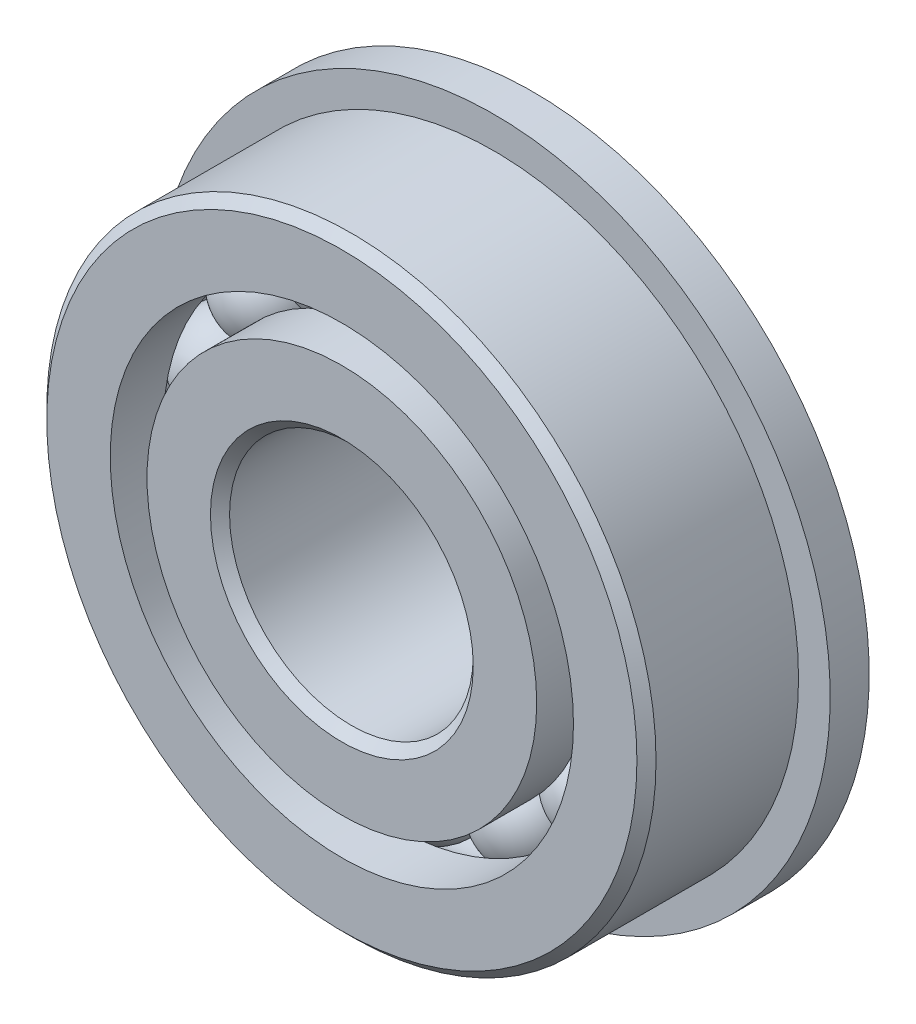
ISO-10303-21;
HEADER;
FILE_DESCRIPTION(('STEP AP214'),'2;1');
FILE_NAME('part.step','',(''),(''),'','','');
FILE_SCHEMA(('AUTOMOTIVE_DESIGN { 1 0 10303 214 1 1 1 1 }'));
ENDSEC;
DATA;
#1=APPLICATION_CONTEXT('core data for automotive mechanical design processes');
#2=APPLICATION_PROTOCOL_DEFINITION('international standard','automotive_design',2000,#1);
#3=PRODUCT_CONTEXT('',#1,'mechanical');
#4=PRODUCT('Part','Part','',(#3));
#5=PRODUCT_RELATED_PRODUCT_CATEGORY('part','',(#4));
#6=PRODUCT_DEFINITION_FORMATION('','',#4);
#7=PRODUCT_DEFINITION_CONTEXT('part definition',#1,'design');
#8=PRODUCT_DEFINITION('design','',#6,#7);
#9=PRODUCT_DEFINITION_SHAPE('','',#8);
#10=(LENGTH_UNIT() NAMED_UNIT(*) SI_UNIT(.MILLI.,.METRE.));
#11=(NAMED_UNIT(*) PLANE_ANGLE_UNIT() SI_UNIT($,.RADIAN.));
#12=(NAMED_UNIT(*) SI_UNIT($,.STERADIAN.) SOLID_ANGLE_UNIT());
#13=UNCERTAINTY_MEASURE_WITH_UNIT(LENGTH_MEASURE(1.E-05),#10,'distance_accuracy_value','');
#14=(GEOMETRIC_REPRESENTATION_CONTEXT(3) GLOBAL_UNCERTAINTY_ASSIGNED_CONTEXT((#13)) GLOBAL_UNIT_ASSIGNED_CONTEXT((#10,
#11,#12)) REPRESENTATION_CONTEXT('',''));
#15=CARTESIAN_POINT('',(0.,0.,0.));
#16=DIRECTION('',(0.,0.,1.));
#17=DIRECTION('',(1.,0.,0.));
#18=AXIS2_PLACEMENT_3D('',#15,#16,#17);
#19=CARTESIAN_POINT('',(-2.41076652547187,5.00600827228285,0.));
#20=DIRECTION('',(0.,0.,1.));
#21=DIRECTION('',(-0.433883739117546,0.900968867902425,0.));
#22=AXIS2_PLACEMENT_3D('',#19,#20,#21);
#23=SPHERICAL_SURFACE('',#22,1.20554465033679);
#24=CARTESIAN_POINT('',(-2.41076652547187,5.00600827228285,1.20554465033679));
#25=VERTEX_POINT('',#24);
#26=VERTEX_LOOP('',#25);
#27=FACE_BOUND('',#26,.T.);
#28=ADVANCED_FACE('F35',(#27),#23,.T.);
#29=CLOSED_SHELL('',(#28));
#30=MANIFOLD_SOLID_BREP('B2',#29);
#31=CARTESIAN_POINT('',(-4.34405117446295,3.46426521157764,0.));
#32=DIRECTION('',(0.,0.,1.));
#33=DIRECTION('',(-0.781831482468022,0.623489801858743,0.));
#34=AXIS2_PLACEMENT_3D('',#31,#32,#33);
#35=SPHERICAL_SURFACE('',#34,1.20554465033679);
#36=CARTESIAN_POINT('',(-4.34405117446295,3.46426521157764,1.20554465033679));
#37=VERTEX_POINT('',#36);
#38=VERTEX_LOOP('',#37);
#39=FACE_BOUND('',#38,.T.);
#40=ADVANCED_FACE('F55',(#39),#35,.T.);
#41=CLOSED_SHELL('',(#40));
#42=MANIFOLD_SOLID_BREP('B6',#41);
#43=CARTESIAN_POINT('',(-5.41694321206024,1.23638193929483,0.));
#44=DIRECTION('',(0.,0.,1.));
#45=DIRECTION('',(-0.974927912181821,0.222520933956325,0.));
#46=AXIS2_PLACEMENT_3D('',#43,#44,#45);
#47=SPHERICAL_SURFACE('',#46,1.20554465033679);
#48=CARTESIAN_POINT('',(-5.41694321206024,1.23638193929483,1.20554465033679));
#49=VERTEX_POINT('',#48);
#50=VERTEX_LOOP('',#49);
#51=FACE_BOUND('',#50,.T.);
#52=ADVANCED_FACE('F75',(#51),#47,.T.);
#53=CLOSED_SHELL('',(#52));
#54=MANIFOLD_SOLID_BREP('B31',#53);
#55=CARTESIAN_POINT('',(-5.41694321206027,-1.23638193929472,0.));
#56=DIRECTION('',(0.,0.,1.));
#57=DIRECTION('',(-0.974927912181826,-0.222520933956305,0.));
#58=AXIS2_PLACEMENT_3D('',#55,#56,#57);
#59=SPHERICAL_SURFACE('',#58,1.20554465033679);
#60=CARTESIAN_POINT('',(-5.41694321206027,-1.23638193929472,1.20554465033679));
#61=VERTEX_POINT('',#60);
#62=VERTEX_LOOP('',#61);
#63=FACE_BOUND('',#62,.T.);
#64=ADVANCED_FACE('F95',(#63),#59,.T.);
#65=CLOSED_SHELL('',(#64));
#66=MANIFOLD_SOLID_BREP('B51',#65);
#67=CARTESIAN_POINT('',(-4.34405117446302,-3.46426521157755,0.));
#68=DIRECTION('',(0.,0.,1.));
#69=DIRECTION('',(-0.781831482468035,-0.623489801858727,0.));
#70=AXIS2_PLACEMENT_3D('',#67,#68,#69);
#71=SPHERICAL_SURFACE('',#70,1.20554465033679);
#72=CARTESIAN_POINT('',(-4.34405117446302,-3.46426521157755,1.20554465033679));
#73=VERTEX_POINT('',#72);
#74=VERTEX_LOOP('',#73);
#75=FACE_BOUND('',#74,.T.);
#76=ADVANCED_FACE('F115',(#75),#71,.T.);
#77=CLOSED_SHELL('',(#76));
#78=MANIFOLD_SOLID_BREP('B71',#77);
#79=CARTESIAN_POINT('',(-2.41076652547197,-5.0060082722828,0.));
#80=DIRECTION('',(0.,0.,1.));
#81=DIRECTION('',(-0.433883739117565,-0.900968867902416,0.));
#82=AXIS2_PLACEMENT_3D('',#79,#80,#81);
#83=SPHERICAL_SURFACE('',#82,1.20554465033679);
#84=CARTESIAN_POINT('',(-2.41076652547197,-5.0060082722828,1.20554465033679));
#85=VERTEX_POINT('',#84);
#86=VERTEX_LOOP('',#85);
#87=FACE_BOUND('',#86,.T.);
#88=ADVANCED_FACE('F135',(#87),#83,.T.);
#89=CLOSED_SHELL('',(#88));
#90=MANIFOLD_SOLID_BREP('B91',#89);
#91=CARTESIAN_POINT('',(0.,-5.55625,0.));
#92=DIRECTION('',(0.,0.,1.));
#93=DIRECTION('',(0.,-1.,0.));
#94=AXIS2_PLACEMENT_3D('',#91,#92,#93);
#95=SPHERICAL_SURFACE('',#94,1.20554465033679);
#96=CARTESIAN_POINT('',(0.,-5.55625,1.20554465033679));
#97=VERTEX_POINT('',#96);
#98=VERTEX_LOOP('',#97);
#99=FACE_BOUND('',#98,.T.);
#100=ADVANCED_FACE('F155',(#99),#95,.T.);
#101=CLOSED_SHELL('',(#100));
#102=MANIFOLD_SOLID_BREP('B111',#101);
#103=CARTESIAN_POINT('',(2.4107665254719,-5.00600827228283,0.));
#104=DIRECTION('',(0.,0.,1.));
#105=DIRECTION('',(0.433883739117553,-0.900968867902422,0.));
#106=AXIS2_PLACEMENT_3D('',#103,#104,#105);
#107=SPHERICAL_SURFACE('',#106,1.20554465033679);
#108=CARTESIAN_POINT('',(2.4107665254719,-5.00600827228283,1.20554465033679));
#109=VERTEX_POINT('',#108);
#110=VERTEX_LOOP('',#109);
#111=FACE_BOUND('',#110,.T.);
#112=ADVANCED_FACE('F175',(#111),#107,.T.);
#113=CLOSED_SHELL('',(#112));
#114=MANIFOLD_SOLID_BREP('B131',#113);
#115=CARTESIAN_POINT('',(4.34405117446297,-3.46426521157761,0.));
#116=DIRECTION('',(0.,0.,1.));
#117=DIRECTION('',(0.781831482468027,-0.623489801858737,0.));
#118=AXIS2_PLACEMENT_3D('',#115,#116,#117);
#119=SPHERICAL_SURFACE('',#118,1.20554465033679);
#120=CARTESIAN_POINT('',(4.34405117446297,-3.46426521157761,1.20554465033679));
#121=VERTEX_POINT('',#120);
#122=VERTEX_LOOP('',#121);
#123=FACE_BOUND('',#122,.T.);
#124=ADVANCED_FACE('F195',(#123),#119,.T.);
#125=CLOSED_SHELL('',(#124));
#126=MANIFOLD_SOLID_BREP('B151',#125);
#127=CARTESIAN_POINT('',(5.41694321206025,-1.23638193929479,0.));
#128=DIRECTION('',(0.,0.,1.));
#129=DIRECTION('',(0.974927912181823,-0.222520933956318,0.));
#130=AXIS2_PLACEMENT_3D('',#127,#128,#129);
#131=SPHERICAL_SURFACE('',#130,1.20554465033679);
#132=CARTESIAN_POINT('',(5.41694321206025,-1.23638193929479,1.20554465033679));
#133=VERTEX_POINT('',#132);
#134=VERTEX_LOOP('',#133);
#135=FACE_BOUND('',#134,.T.);
#136=ADVANCED_FACE('F215',(#135),#131,.T.);
#137=CLOSED_SHELL('',(#136));
#138=MANIFOLD_SOLID_BREP('B171',#137);
#139=CARTESIAN_POINT('',(5.41694321206026,1.23638193929476,0.));
#140=DIRECTION('',(0.,0.,1.));
#141=DIRECTION('',(0.974927912181824,0.222520933956311,0.));
#142=AXIS2_PLACEMENT_3D('',#139,#140,#141);
#143=SPHERICAL_SURFACE('',#142,1.20554465033679);
#144=CARTESIAN_POINT('',(5.41694321206026,1.23638193929476,1.20554465033679));
#145=VERTEX_POINT('',#144);
#146=VERTEX_LOOP('',#145);
#147=FACE_BOUND('',#146,.T.);
#148=ADVANCED_FACE('F235',(#147),#143,.T.);
#149=CLOSED_SHELL('',(#148));
#150=MANIFOLD_SOLID_BREP('B191',#149);
#151=CARTESIAN_POINT('',(4.344051174463,3.46426521157758,0.));
#152=DIRECTION('',(0.,0.,1.));
#153=DIRECTION('',(0.781831482468031,0.623489801858732,0.));
#154=AXIS2_PLACEMENT_3D('',#151,#152,#153);
#155=SPHERICAL_SURFACE('',#154,1.20554465033679);
#156=CARTESIAN_POINT('',(4.344051174463,3.46426521157758,1.20554465033679));
#157=VERTEX_POINT('',#156);
#158=VERTEX_LOOP('',#157);
#159=FACE_BOUND('',#158,.T.);
#160=ADVANCED_FACE('F255',(#159),#155,.T.);
#161=CLOSED_SHELL('',(#160));
#162=MANIFOLD_SOLID_BREP('B211',#161);
#163=CARTESIAN_POINT('',(2.41076652547194,5.00600827228281,0.));
#164=DIRECTION('',(0.,0.,1.));
#165=DIRECTION('',(0.433883739117559,0.900968867902419,0.));
#166=AXIS2_PLACEMENT_3D('',#163,#164,#165);
#167=SPHERICAL_SURFACE('',#166,1.20554465033679);
#168=CARTESIAN_POINT('',(2.41076652547194,5.00600827228281,1.20554465033679));
#169=VERTEX_POINT('',#168);
#170=VERTEX_LOOP('',#169);
#171=FACE_BOUND('',#170,.T.);
#172=ADVANCED_FACE('F275',(#171),#167,.T.);
#173=CLOSED_SHELL('',(#172));
#174=MANIFOLD_SOLID_BREP('B231',#173);
#175=CARTESIAN_POINT('',(0.,5.55625,0.));
#176=DIRECTION('',(0.,0.,1.));
#177=DIRECTION('',(0.,1.,0.));
#178=AXIS2_PLACEMENT_3D('',#175,#176,#177);
#179=SPHERICAL_SURFACE('',#178,1.20554465033679);
#180=CARTESIAN_POINT('',(0.,5.55625,1.20554465033679));
#181=VERTEX_POINT('',#180);
#182=VERTEX_LOOP('',#181);
#183=FACE_BOUND('',#182,.T.);
#184=ADVANCED_FACE('F298',(#183),#179,.T.);
#185=CLOSED_SHELL('',(#184));
#186=MANIFOLD_SOLID_BREP('B251',#185);
#187=CARTESIAN_POINT('',(0.,5.07727857142857,2.4892));
#188=DIRECTION('',(0.,0.,-1.));
#189=DIRECTION('',(-1.,0.,0.));
#190=AXIS2_PLACEMENT_3D('',#187,#188,#189);
#191=PLANE('',#190);
#192=CARTESIAN_POINT('',(0.,0.,2.4892));
#193=DIRECTION('',(0.,0.,1.));
#194=DIRECTION('',(1.,0.,0.));
#195=AXIS2_PLACEMENT_3D('',#192,#193,#194);
#196=CIRCLE('',#195,3.42392);
#197=CARTESIAN_POINT('',(3.42392,0.,2.4892));
#198=VERTEX_POINT('',#197);
#199=EDGE_CURVE('E346',#198,#198,#196,.T.);
#200=ORIENTED_EDGE('',*,*,#199,.F.);
#201=EDGE_LOOP('',(#200));
#202=FACE_BOUND('',#201,.T.);
#203=CARTESIAN_POINT('',(0.,0.,2.4892));
#204=DIRECTION('',(0.,0.,1.));
#205=DIRECTION('',(1.,0.,0.));
#206=AXIS2_PLACEMENT_3D('',#203,#204,#205);
#207=CIRCLE('',#206,5.07727857142857);
#208=CARTESIAN_POINT('',(5.07727857142857,0.,2.4892));
#209=VERTEX_POINT('',#208);
#210=EDGE_CURVE('E297',#209,#209,#207,.T.);
#211=ORIENTED_EDGE('',*,*,#210,.T.);
#212=EDGE_LOOP('',(#211));
#213=FACE_BOUND('',#212,.T.);
#214=ADVANCED_FACE('F318',(#202,#213),#191,.F.);
#215=CARTESIAN_POINT('',(0.,0.,2.4892));
#216=DIRECTION('',(0.,0.,1.));
#217=DIRECTION('',(1.,0.,0.));
#218=AXIS2_PLACEMENT_3D('',#215,#216,#217);
#219=CYLINDRICAL_SURFACE('',#218,5.07727857142857);
#220=ORIENTED_EDGE('',*,*,#210,.F.);
#221=EDGE_LOOP('',(#220));
#222=FACE_BOUND('',#221,.T.);
#223=CARTESIAN_POINT('',(0.,0.,1.10631111111111));
#224=DIRECTION('',(0.,0.,1.));
#225=DIRECTION('',(1.,0.,0.));
#226=AXIS2_PLACEMENT_3D('',#223,#224,#225);
#227=CIRCLE('',#226,5.07727857142857);
#228=CARTESIAN_POINT('',(5.07727857142857,0.,1.10631111111111));
#229=VERTEX_POINT('',#228);
#230=EDGE_CURVE('E324',#229,#229,#227,.T.);
#231=ORIENTED_EDGE('',*,*,#230,.T.);
#232=EDGE_LOOP('',(#231));
#233=FACE_BOUND('',#232,.T.);
#234=ADVANCED_FACE('F353',(#222,#233),#219,.T.);
#235=CARTESIAN_POINT('',(0.,0.,0.));
#236=DIRECTION('',(0.,0.,1.));
#237=DIRECTION('',(1.,0.,0.));
#238=AXIS2_PLACEMENT_3D('',#235,#236,#237);
#239=TOROIDAL_SURFACE('',#238,5.55625,1.20554465033679);
#240=ORIENTED_EDGE('',*,*,#230,.F.);
#241=EDGE_LOOP('',(#240));
#242=FACE_BOUND('',#241,.T.);
#243=CARTESIAN_POINT('',(0.,0.,-1.10631111111111));
#244=DIRECTION('',(0.,0.,1.));
#245=DIRECTION('',(1.,0.,0.));
#246=AXIS2_PLACEMENT_3D('',#243,#244,#245);
#247=CIRCLE('',#246,5.07727857142857);
#248=CARTESIAN_POINT('',(5.07727857142857,0.,-1.10631111111111));
#249=VERTEX_POINT('',#248);
#250=EDGE_CURVE('E328',#249,#249,#247,.T.);
#251=ORIENTED_EDGE('',*,*,#250,.T.);
#252=EDGE_LOOP('',(#251));
#253=FACE_BOUND('',#252,.T.);
#254=ADVANCED_FACE('F357',(#242,#253),#239,.F.);
#255=CARTESIAN_POINT('',(0.,0.,2.4892));
#256=DIRECTION('',(0.,0.,1.));
#257=DIRECTION('',(1.,0.,0.));
#258=AXIS2_PLACEMENT_3D('',#255,#256,#257);
#259=CYLINDRICAL_SURFACE('',#258,5.07727857142857);
#260=ORIENTED_EDGE('',*,*,#250,.F.);
#261=EDGE_LOOP('',(#260));
#262=FACE_BOUND('',#261,.T.);
#263=CARTESIAN_POINT('',(0.,0.,-2.4892));
#264=DIRECTION('',(0.,0.,1.));
#265=DIRECTION('',(1.,0.,0.));
#266=AXIS2_PLACEMENT_3D('',#263,#264,#265);
#267=CIRCLE('',#266,5.07727857142857);
#268=CARTESIAN_POINT('',(5.07727857142857,0.,-2.4892));
#269=VERTEX_POINT('',#268);
#270=EDGE_CURVE('E332',#269,#269,#267,.T.);
#271=ORIENTED_EDGE('',*,*,#270,.T.);
#272=EDGE_LOOP('',(#271));
#273=FACE_BOUND('',#272,.T.);
#274=ADVANCED_FACE('F362',(#262,#273),#259,.T.);
#275=CARTESIAN_POINT('',(0.,3.42392,-2.4892));
#276=DIRECTION('',(0.,0.,1.));
#277=DIRECTION('',(1.,0.,0.));
#278=AXIS2_PLACEMENT_3D('',#275,#276,#277);
#279=PLANE('',#278);
#280=ORIENTED_EDGE('',*,*,#270,.F.);
#281=EDGE_LOOP('',(#280));
#282=FACE_BOUND('',#281,.T.);
#283=CARTESIAN_POINT('',(0.,0.,-2.4892));
#284=DIRECTION('',(0.,0.,1.));
#285=DIRECTION('',(1.,0.,0.));
#286=AXIS2_PLACEMENT_3D('',#283,#284,#285);
#287=CIRCLE('',#286,3.42392);
#288=CARTESIAN_POINT('',(3.42392,0.,-2.4892));
#289=VERTEX_POINT('',#288);
#290=EDGE_CURVE('E337',#289,#289,#287,.T.);
#291=ORIENTED_EDGE('',*,*,#290,.T.);
#292=EDGE_LOOP('',(#291));
#293=FACE_BOUND('',#292,.T.);
#294=ADVANCED_FACE('F368',(#282,#293),#279,.F.);
#295=CARTESIAN_POINT('',(0.,0.,-2.24028));
#296=DIRECTION('',(0.,0.,-1.));
#297=DIRECTION('',(-1.,0.,0.));
#298=AXIS2_PLACEMENT_3D('',#295,#296,#297);
#299=CONICAL_SURFACE('',#298,3.175,0.785398163397447);
#300=ORIENTED_EDGE('',*,*,#290,.F.);
#301=EDGE_LOOP('',(#300));
#302=FACE_BOUND('',#301,.T.);
#303=CARTESIAN_POINT('',(0.,0.,-2.24028));
#304=DIRECTION('',(0.,0.,1.));
#305=DIRECTION('',(1.,0.,0.));
#306=AXIS2_PLACEMENT_3D('',#303,#304,#305);
#307=CIRCLE('',#306,3.175);
#308=CARTESIAN_POINT('',(3.175,0.,-2.24028));
#309=VERTEX_POINT('',#308);
#310=EDGE_CURVE('E340',#309,#309,#307,.T.);
#311=ORIENTED_EDGE('',*,*,#310,.T.);
#312=EDGE_LOOP('',(#311));
#313=FACE_BOUND('',#312,.T.);
#314=ADVANCED_FACE('F372',(#302,#313),#299,.F.);
#315=CARTESIAN_POINT('',(0.,0.,2.4892));
#316=DIRECTION('',(0.,0.,1.));
#317=DIRECTION('',(1.,0.,0.));
#318=AXIS2_PLACEMENT_3D('',#315,#316,#317);
#319=CYLINDRICAL_SURFACE('',#318,3.175);
#320=ORIENTED_EDGE('',*,*,#310,.F.);
#321=EDGE_LOOP('',(#320));
#322=FACE_BOUND('',#321,.T.);
#323=CARTESIAN_POINT('',(0.,0.,2.24028));
#324=DIRECTION('',(0.,0.,1.));
#325=DIRECTION('',(1.,0.,0.));
#326=AXIS2_PLACEMENT_3D('',#323,#324,#325);
#327=CIRCLE('',#326,3.175);
#328=CARTESIAN_POINT('',(3.175,0.,2.24028));
#329=VERTEX_POINT('',#328);
#330=EDGE_CURVE('E343',#329,#329,#327,.T.);
#331=ORIENTED_EDGE('',*,*,#330,.T.);
#332=EDGE_LOOP('',(#331));
#333=FACE_BOUND('',#332,.T.);
#334=ADVANCED_FACE('F376',(#322,#333),#319,.F.);
#335=CARTESIAN_POINT('',(0.,0.,2.4892));
#336=DIRECTION('',(0.,0.,1.));
#337=DIRECTION('',(1.,0.,0.));
#338=AXIS2_PLACEMENT_3D('',#335,#336,#337);
#339=CONICAL_SURFACE('',#338,3.42392,0.785398163397448);
#340=ORIENTED_EDGE('',*,*,#330,.F.);
#341=EDGE_LOOP('',(#340));
#342=FACE_BOUND('',#341,.T.);
#343=ORIENTED_EDGE('',*,*,#199,.T.);
#344=EDGE_LOOP('',(#343));
#345=FACE_BOUND('',#344,.T.);
#346=ADVANCED_FACE('F350',(#342,#345),#339,.F.);
#347=CLOSED_SHELL('',(#214,#234,#254,#274,#294,#314,#334,#346));
#348=MANIFOLD_SOLID_BREP('B271',#347);
#349=CARTESIAN_POINT('',(0.,0.,2.24028));
#350=DIRECTION('',(0.,0.,-1.));
#351=DIRECTION('',(-1.,0.,0.));
#352=AXIS2_PLACEMENT_3D('',#349,#350,#351);
#353=CONICAL_SURFACE('',#352,7.9375,0.785398163397448);
#354=CARTESIAN_POINT('',(0.,0.,2.4892));
#355=DIRECTION('',(0.,0.,1.));
#356=DIRECTION('',(1.,0.,0.));
#357=AXIS2_PLACEMENT_3D('',#354,#355,#356);
#358=CIRCLE('',#357,7.68858);
#359=CARTESIAN_POINT('',(7.68858,0.,2.4892));
#360=VERTEX_POINT('',#359);
#361=EDGE_CURVE('E462',#360,#360,#358,.T.);
#362=ORIENTED_EDGE('',*,*,#361,.F.);
#363=EDGE_LOOP('',(#362));
#364=FACE_BOUND('',#363,.T.);
#365=CARTESIAN_POINT('',(0.,0.,2.24028));
#366=DIRECTION('',(0.,0.,1.));
#367=DIRECTION('',(1.,0.,0.));
#368=AXIS2_PLACEMENT_3D('',#365,#366,#367);
#369=CIRCLE('',#368,7.9375);
#370=CARTESIAN_POINT('',(7.9375,0.,2.24028));
#371=VERTEX_POINT('',#370);
#372=EDGE_CURVE('E317',#371,#371,#369,.T.);
#373=ORIENTED_EDGE('',*,*,#372,.T.);
#374=EDGE_LOOP('',(#373));
#375=FACE_BOUND('',#374,.T.);
#376=ADVANCED_FACE('F440',(#364,#375),#353,.T.);
#377=CARTESIAN_POINT('',(0.,0.,2.4892));
#378=DIRECTION('',(0.,0.,1.));
#379=DIRECTION('',(1.,0.,0.));
#380=AXIS2_PLACEMENT_3D('',#377,#378,#379);
#381=CYLINDRICAL_SURFACE('',#380,7.9375);
#382=CARTESIAN_POINT('',(0.,0.,-1.4732));
#383=DIRECTION('',(0.,0.,1.));
#384=DIRECTION('',(1.,0.,0.));
#385=AXIS2_PLACEMENT_3D('',#382,#383,#384);
#386=CIRCLE('',#385,7.9375);
#387=CARTESIAN_POINT('',(7.9375,0.,-1.4732));
#388=VERTEX_POINT('',#387);
#389=EDGE_CURVE('E443',#388,#388,#386,.T.);
#390=ORIENTED_EDGE('',*,*,#389,.T.);
#391=EDGE_LOOP('',(#390));
#392=FACE_BOUND('',#391,.T.);
#393=ORIENTED_EDGE('',*,*,#372,.F.);
#394=EDGE_LOOP('',(#393));
#395=FACE_BOUND('',#394,.T.);
#396=ADVANCED_FACE('F483',(#392,#395),#381,.T.);
#397=CARTESIAN_POINT('',(0.,7.68858,-2.4892));
#398=DIRECTION('',(0.,0.,1.));
#399=DIRECTION('',(1.,0.,0.));
#400=AXIS2_PLACEMENT_3D('',#397,#398,#399);
#401=PLANE('',#400);
#402=CARTESIAN_POINT('',(0.,0.,-2.4892));
#403=DIRECTION('',(0.,0.,1.));
#404=DIRECTION('',(1.,0.,0.));
#405=AXIS2_PLACEMENT_3D('',#402,#403,#404);
#406=CIRCLE('',#405,6.03522142857143);
#407=CARTESIAN_POINT('',(6.03522142857143,0.,-2.4892));
#408=VERTEX_POINT('',#407);
#409=EDGE_CURVE('E447',#408,#408,#406,.T.);
#410=ORIENTED_EDGE('',*,*,#409,.T.);
#411=EDGE_LOOP('',(#410));
#412=FACE_BOUND('',#411,.T.);
#413=CARTESIAN_POINT('',(0.,0.,-2.4892));
#414=DIRECTION('',(0.,0.,-1.));
#415=DIRECTION('',(-1.,0.,0.));
#416=AXIS2_PLACEMENT_3D('',#413,#414,#415);
#417=CIRCLE('',#416,8.763);
#418=CARTESIAN_POINT('',(-8.763,0.,-2.4892));
#419=VERTEX_POINT('',#418);
#420=EDGE_CURVE('E465',#419,#419,#417,.T.);
#421=ORIENTED_EDGE('',*,*,#420,.T.);
#422=EDGE_LOOP('',(#421));
#423=FACE_BOUND('',#422,.T.);
#424=ADVANCED_FACE('F486',(#412,#423),#401,.F.);
#425=CARTESIAN_POINT('',(0.,0.,2.4892));
#426=DIRECTION('',(0.,0.,1.));
#427=DIRECTION('',(1.,0.,0.));
#428=AXIS2_PLACEMENT_3D('',#425,#426,#427);
#429=CYLINDRICAL_SURFACE('',#428,6.03522142857143);
#430=ORIENTED_EDGE('',*,*,#409,.F.);
#431=EDGE_LOOP('',(#430));
#432=FACE_BOUND('',#431,.T.);
#433=CARTESIAN_POINT('',(0.,0.,-1.10631111111111));
#434=DIRECTION('',(0.,0.,1.));
#435=DIRECTION('',(1.,0.,0.));
#436=AXIS2_PLACEMENT_3D('',#433,#434,#435);
#437=CIRCLE('',#436,6.03522142857143);
#438=CARTESIAN_POINT('',(6.03522142857143,0.,-1.10631111111111));
#439=VERTEX_POINT('',#438);
#440=EDGE_CURVE('E451',#439,#439,#437,.T.);
#441=ORIENTED_EDGE('',*,*,#440,.T.);
#442=EDGE_LOOP('',(#441));
#443=FACE_BOUND('',#442,.T.);
#444=ADVANCED_FACE('F491',(#432,#443),#429,.F.);
#445=CARTESIAN_POINT('',(0.,0.,0.));
#446=DIRECTION('',(0.,0.,1.));
#447=DIRECTION('',(1.,0.,0.));
#448=AXIS2_PLACEMENT_3D('',#445,#446,#447);
#449=TOROIDAL_SURFACE('',#448,5.55625,1.20554465033679);
#450=ORIENTED_EDGE('',*,*,#440,.F.);
#451=EDGE_LOOP('',(#450));
#452=FACE_BOUND('',#451,.T.);
#453=CARTESIAN_POINT('',(0.,0.,1.10631111111111));
#454=DIRECTION('',(0.,0.,1.));
#455=DIRECTION('',(1.,0.,0.));
#456=AXIS2_PLACEMENT_3D('',#453,#454,#455);
#457=CIRCLE('',#456,6.03522142857143);
#458=CARTESIAN_POINT('',(6.03522142857143,0.,1.10631111111111));
#459=VERTEX_POINT('',#458);
#460=EDGE_CURVE('E456',#459,#459,#457,.T.);
#461=ORIENTED_EDGE('',*,*,#460,.T.);
#462=EDGE_LOOP('',(#461));
#463=FACE_BOUND('',#462,.T.);
#464=ADVANCED_FACE('F498',(#452,#463),#449,.F.);
#465=CARTESIAN_POINT('',(0.,0.,2.4892));
#466=DIRECTION('',(0.,0.,1.));
#467=DIRECTION('',(1.,0.,0.));
#468=AXIS2_PLACEMENT_3D('',#465,#466,#467);
#469=CYLINDRICAL_SURFACE('',#468,6.03522142857143);
#470=ORIENTED_EDGE('',*,*,#460,.F.);
#471=EDGE_LOOP('',(#470));
#472=FACE_BOUND('',#471,.T.);
#473=CARTESIAN_POINT('',(0.,0.,2.4892));
#474=DIRECTION('',(0.,0.,1.));
#475=DIRECTION('',(1.,0.,0.));
#476=AXIS2_PLACEMENT_3D('',#473,#474,#475);
#477=CIRCLE('',#476,6.03522142857143);
#478=CARTESIAN_POINT('',(6.03522142857143,0.,2.4892));
#479=VERTEX_POINT('',#478);
#480=EDGE_CURVE('E459',#479,#479,#477,.T.);
#481=ORIENTED_EDGE('',*,*,#480,.T.);
#482=EDGE_LOOP('',(#481));
#483=FACE_BOUND('',#482,.T.);
#484=ADVANCED_FACE('F502',(#472,#483),#469,.F.);
#485=CARTESIAN_POINT('',(0.,7.68858,2.4892));
#486=DIRECTION('',(0.,0.,-1.));
#487=DIRECTION('',(-1.,0.,0.));
#488=AXIS2_PLACEMENT_3D('',#485,#486,#487);
#489=PLANE('',#488);
#490=ORIENTED_EDGE('',*,*,#480,.F.);
#491=EDGE_LOOP('',(#490));
#492=FACE_BOUND('',#491,.T.);
#493=ORIENTED_EDGE('',*,*,#361,.T.);
#494=EDGE_LOOP('',(#493));
#495=FACE_BOUND('',#494,.T.);
#496=ADVANCED_FACE('F478',(#492,#495),#489,.F.);
#497=CARTESIAN_POINT('',(0.,6.86190071428571,-1.4732));
#498=DIRECTION('',(0.,0.,1.));
#499=DIRECTION('',(1.,0.,0.));
#500=AXIS2_PLACEMENT_3D('',#497,#498,#499);
#501=PLANE('',#500);
#502=CARTESIAN_POINT('',(0.,0.,-1.4732));
#503=DIRECTION('',(0.,0.,-1.));
#504=DIRECTION('',(-1.,0.,0.));
#505=AXIS2_PLACEMENT_3D('',#502,#503,#504);
#506=CIRCLE('',#505,8.763);
#507=CARTESIAN_POINT('',(-8.763,0.,-1.4732));
#508=VERTEX_POINT('',#507);
#509=EDGE_CURVE('E468',#508,#508,#506,.T.);
#510=ORIENTED_EDGE('',*,*,#509,.F.);
#511=EDGE_LOOP('',(#510));
#512=FACE_BOUND('',#511,.T.);
#513=ORIENTED_EDGE('',*,*,#389,.F.);
#514=EDGE_LOOP('',(#513));
#515=FACE_BOUND('',#514,.T.);
#516=ADVANCED_FACE('F475',(#512,#515),#501,.T.);
#517=CARTESIAN_POINT('',(0.,0.,-2.4892));
#518=DIRECTION('',(0.,0.,-1.));
#519=DIRECTION('',(-1.,0.,0.));
#520=AXIS2_PLACEMENT_3D('',#517,#518,#519);
#521=CYLINDRICAL_SURFACE('',#520,8.763);
#522=ORIENTED_EDGE('',*,*,#509,.T.);
#523=EDGE_LOOP('',(#522));
#524=FACE_BOUND('',#523,.T.);
#525=ORIENTED_EDGE('',*,*,#420,.F.);
#526=EDGE_LOOP('',(#525));
#527=FACE_BOUND('',#526,.T.);
#528=ADVANCED_FACE('F472',(#524,#527),#521,.T.);
#529=CLOSED_SHELL('',(#376,#396,#424,#444,#464,#484,#496,#516,#528));
#530=MANIFOLD_SOLID_BREP('B292',#529);
#531=ADVANCED_BREP_SHAPE_REPRESENTATION('',(#18,#30,#42,#54,#66,#78,#90,#102,#114,#126,#138,
#150,#162,#174,#186,#348,#530),#14);
#532=SHAPE_DEFINITION_REPRESENTATION(#9,#531);
ENDSEC;
END-ISO-10303-21;
